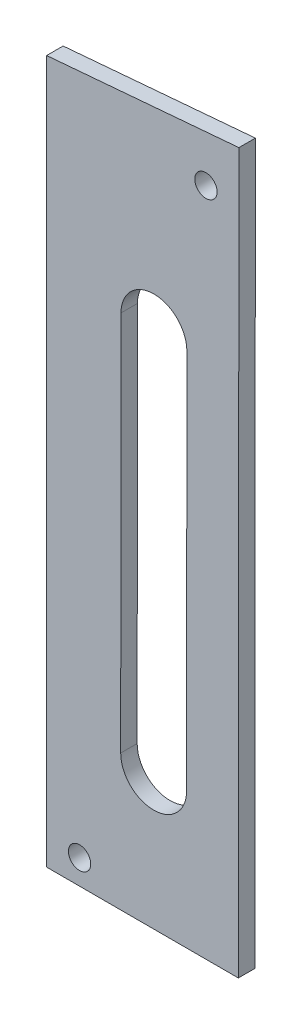
ISO-10303-21;
HEADER;
FILE_DESCRIPTION(('STEP AP214'),'2;1');
FILE_NAME('part.step','',(''),(''),'','','');
FILE_SCHEMA(('AUTOMOTIVE_DESIGN { 1 0 10303 214 1 1 1 1 }'));
ENDSEC;
DATA;
#1=APPLICATION_CONTEXT('core data for automotive mechanical design processes');
#2=APPLICATION_PROTOCOL_DEFINITION('international standard','automotive_design',2000,#1);
#3=PRODUCT_CONTEXT('',#1,'mechanical');
#4=PRODUCT('Part','Part','',(#3));
#5=PRODUCT_RELATED_PRODUCT_CATEGORY('part','',(#4));
#6=PRODUCT_DEFINITION_FORMATION('','',#4);
#7=PRODUCT_DEFINITION_CONTEXT('part definition',#1,'design');
#8=PRODUCT_DEFINITION('design','',#6,#7);
#9=PRODUCT_DEFINITION_SHAPE('','',#8);
#10=(LENGTH_UNIT() NAMED_UNIT(*) SI_UNIT(.MILLI.,.METRE.));
#11=(NAMED_UNIT(*) PLANE_ANGLE_UNIT() SI_UNIT($,.RADIAN.));
#12=(NAMED_UNIT(*) SI_UNIT($,.STERADIAN.) SOLID_ANGLE_UNIT());
#13=UNCERTAINTY_MEASURE_WITH_UNIT(LENGTH_MEASURE(1.E-05),#10,'distance_accuracy_value','');
#14=(GEOMETRIC_REPRESENTATION_CONTEXT(3) GLOBAL_UNCERTAINTY_ASSIGNED_CONTEXT((#13)) GLOBAL_UNIT_ASSIGNED_CONTEXT((#10,
#11,#12)) REPRESENTATION_CONTEXT('',''));
#15=CARTESIAN_POINT('',(0.,0.,0.));
#16=DIRECTION('',(0.,0.,1.));
#17=DIRECTION('',(1.,0.,0.));
#18=AXIS2_PLACEMENT_3D('',#15,#16,#17);
#19=CARTESIAN_POINT('',(0.,0.,3.175));
#20=DIRECTION('',(0.,0.,-1.));
#21=DIRECTION('',(-1.,0.,0.));
#22=AXIS2_PLACEMENT_3D('',#19,#20,#21);
#23=PLANE('',#22);
#24=CARTESIAN_POINT('',(859.905952239611,6619.18728784692,3.175));
#25=DIRECTION('',(0.,0.,1.));
#26=DIRECTION('',(1.,0.,0.));
#27=AXIS2_PLACEMENT_3D('',#24,#25,#26);
#28=CIRCLE('',#27,2.15264999999998);
#29=CARTESIAN_POINT('',(862.058602239611,6619.18728784692,3.175));
#30=VERTEX_POINT('',#29);
#31=EDGE_CURVE('E229',#30,#30,#28,.T.);
#32=ORIENTED_EDGE('',*,*,#31,.F.);
#33=EDGE_LOOP('',(#32));
#34=FACE_BOUND('',#33,.T.);
#35=CARTESIAN_POINT('',(835.549261489273,6494.79713763315,3.175));
#36=DIRECTION('',(0.,0.,1.));
#37=DIRECTION('',(1.,0.,0.));
#38=AXIS2_PLACEMENT_3D('',#35,#36,#37);
#39=CIRCLE('',#38,2.15264999999998);
#40=CARTESIAN_POINT('',(837.701911489273,6494.79713763315,3.175));
#41=VERTEX_POINT('',#40);
#42=EDGE_CURVE('E231',#41,#41,#39,.T.);
#43=ORIENTED_EDGE('',*,*,#42,.F.);
#44=EDGE_LOOP('',(#43));
#45=FACE_BOUND('',#44,.T.);
#46=DIRECTION('',(0.000771841579948994,0.999999702130243,0.));
#47=VECTOR('',#46,1.);
#48=CARTESIAN_POINT('',(866.263292558574,6628.69497115099,3.175));
#49=LINE('',#48,#47);
#50=CARTESIAN_POINT('',(866.1562504809,6490.01101246076,3.175));
#51=VERTEX_POINT('',#50);
#52=CARTESIAN_POINT('',(866.263292558574,6628.69497115099,3.175));
#53=VERTEX_POINT('',#52);
#54=EDGE_CURVE('E135',#51,#53,#49,.T.);
#55=ORIENTED_EDGE('',*,*,#54,.T.);
#56=DIRECTION('',(-0.996390512773561,-0.0848878439756821,0.));
#57=VECTOR('',#56,1.);
#58=CARTESIAN_POINT('',(829.199261489273,6625.53728784692,3.175));
#59=LINE('',#58,#57);
#60=CARTESIAN_POINT('',(829.199261489273,6625.53728784692,3.175));
#61=VERTEX_POINT('',#60);
#62=EDGE_CURVE('E138',#53,#61,#59,.T.);
#63=ORIENTED_EDGE('',*,*,#62,.T.);
#64=DIRECTION('',(0.,-1.,0.));
#65=VECTOR('',#64,1.);
#66=CARTESIAN_POINT('',(829.199261489273,6490.03953741003,3.175));
#67=LINE('',#66,#65);
#68=CARTESIAN_POINT('',(829.199261489273,6490.03953741003,3.175));
#69=VERTEX_POINT('',#68);
#70=EDGE_CURVE('E141',#61,#69,#67,.T.);
#71=ORIENTED_EDGE('',*,*,#70,.T.);
#72=DIRECTION('',(0.999999702130243,-0.000771841579949462,0.));
#73=VECTOR('',#72,1.);
#74=CARTESIAN_POINT('',(866.1562504809,6490.01101246076,3.175));
#75=LINE('',#74,#73);
#76=EDGE_CURVE('E143',#69,#51,#75,.T.);
#77=ORIENTED_EDGE('',*,*,#76,.T.);
#78=EDGE_LOOP('',(#55,#63,#71,#77));
#79=FACE_BOUND('',#78,.T.);
#80=CARTESIAN_POINT('',(849.883207999537,6589.72360237298,3.175));
#81=DIRECTION('',(0.,0.,1.));
#82=DIRECTION('',(1.,0.,0.));
#83=AXIS2_PLACEMENT_3D('',#80,#81,#82);
#84=CIRCLE('',#83,6.35000000000005);
#85=CARTESIAN_POINT('',(856.233206108064,6589.71870117895,3.175));
#86=VERTEX_POINT('',#85);
#87=CARTESIAN_POINT('',(843.53320989101,6589.72850356701,3.175));
#88=VERTEX_POINT('',#87);
#89=EDGE_CURVE('E97',#86,#88,#84,.T.);
#90=ORIENTED_EDGE('',*,*,#89,.F.);
#91=DIRECTION('',(0.000771841579834854,0.999999702130243,0.));
#92=VECTOR('',#91,1.);
#93=CARTESIAN_POINT('',(856.233206108064,6589.71870117895,3.175));
#94=LINE('',#93,#92);
#95=CARTESIAN_POINT('',(856.176475751946,6516.21872307238,3.175));
#96=VERTEX_POINT('',#95);
#97=EDGE_CURVE('E119',#96,#86,#94,.T.);
#98=ORIENTED_EDGE('',*,*,#97,.F.);
#99=CARTESIAN_POINT('',(849.826477643419,6516.22362426641,3.175));
#100=DIRECTION('',(0.,0.,1.));
#101=DIRECTION('',(1.,0.,0.));
#102=AXIS2_PLACEMENT_3D('',#99,#100,#101);
#103=CIRCLE('',#102,6.35000000000005);
#104=CARTESIAN_POINT('',(843.476479534892,6516.22852546044,3.175));
#105=VERTEX_POINT('',#104);
#106=EDGE_CURVE('E117',#105,#96,#103,.T.);
#107=ORIENTED_EDGE('',*,*,#106,.F.);
#108=DIRECTION('',(-0.000771841579834854,-0.999999702130243,0.));
#109=VECTOR('',#108,1.);
#110=CARTESIAN_POINT('',(843.53320989101,6589.72850356701,3.175));
#111=LINE('',#110,#109);
#112=EDGE_CURVE('E105',#88,#105,#111,.T.);
#113=ORIENTED_EDGE('',*,*,#112,.F.);
#114=EDGE_LOOP('',(#90,#98,#107,#113));
#115=FACE_BOUND('',#114,.T.);
#116=ADVANCED_FACE('F32',(#34,#45,#79,#115),#23,.F.);
#117=CARTESIAN_POINT('',(0.,0.,0.));
#118=DIRECTION('',(0.,0.,-1.));
#119=DIRECTION('',(-1.,0.,0.));
#120=AXIS2_PLACEMENT_3D('',#117,#118,#119);
#121=PLANE('',#120);
#122=CARTESIAN_POINT('',(859.905952239611,6619.18728784692,0.));
#123=DIRECTION('',(0.,0.,1.));
#124=DIRECTION('',(1.,0.,0.));
#125=AXIS2_PLACEMENT_3D('',#122,#123,#124);
#126=CIRCLE('',#125,2.15264999999998);
#127=CARTESIAN_POINT('',(862.058602239611,6619.18728784692,0.));
#128=VERTEX_POINT('',#127);
#129=EDGE_CURVE('E227',#128,#128,#126,.T.);
#130=ORIENTED_EDGE('',*,*,#129,.T.);
#131=EDGE_LOOP('',(#130));
#132=FACE_BOUND('',#131,.T.);
#133=CARTESIAN_POINT('',(835.549261489273,6494.79713763315,0.));
#134=DIRECTION('',(0.,0.,1.));
#135=DIRECTION('',(1.,0.,0.));
#136=AXIS2_PLACEMENT_3D('',#133,#134,#135);
#137=CIRCLE('',#136,2.15264999999998);
#138=CARTESIAN_POINT('',(837.701911489273,6494.79713763315,0.));
#139=VERTEX_POINT('',#138);
#140=EDGE_CURVE('E125',#139,#139,#137,.T.);
#141=ORIENTED_EDGE('',*,*,#140,.T.);
#142=EDGE_LOOP('',(#141));
#143=FACE_BOUND('',#142,.T.);
#144=DIRECTION('',(0.000771841579948994,0.999999702130243,0.));
#145=VECTOR('',#144,1.);
#146=CARTESIAN_POINT('',(866.263292558574,6628.69497115099,0.));
#147=LINE('',#146,#145);
#148=CARTESIAN_POINT('',(866.1562504809,6490.01101246076,0.));
#149=VERTEX_POINT('',#148);
#150=CARTESIAN_POINT('',(866.263292558574,6628.69497115099,0.));
#151=VERTEX_POINT('',#150);
#152=EDGE_CURVE('E113',#149,#151,#147,.T.);
#153=ORIENTED_EDGE('',*,*,#152,.F.);
#154=DIRECTION('',(0.999999702130243,-0.000771841579949462,0.));
#155=VECTOR('',#154,1.);
#156=CARTESIAN_POINT('',(866.1562504809,6490.01101246076,0.));
#157=LINE('',#156,#155);
#158=CARTESIAN_POINT('',(829.199261489273,6490.03953741003,0.));
#159=VERTEX_POINT('',#158);
#160=EDGE_CURVE('E139',#159,#149,#157,.T.);
#161=ORIENTED_EDGE('',*,*,#160,.F.);
#162=DIRECTION('',(0.,-1.,0.));
#163=VECTOR('',#162,1.);
#164=CARTESIAN_POINT('',(829.199261489273,6490.03953741003,0.));
#165=LINE('',#164,#163);
#166=CARTESIAN_POINT('',(829.199261489273,6625.53728784692,0.));
#167=VERTEX_POINT('',#166);
#168=EDGE_CURVE('E150',#167,#159,#165,.T.);
#169=ORIENTED_EDGE('',*,*,#168,.F.);
#170=DIRECTION('',(-0.996390512773561,-0.0848878439756821,0.));
#171=VECTOR('',#170,1.);
#172=CARTESIAN_POINT('',(829.199261489273,6625.53728784692,0.));
#173=LINE('',#172,#171);
#174=EDGE_CURVE('E148',#151,#167,#173,.T.);
#175=ORIENTED_EDGE('',*,*,#174,.F.);
#176=EDGE_LOOP('',(#153,#161,#169,#175));
#177=FACE_BOUND('',#176,.T.);
#178=DIRECTION('',(0.000771841579834854,0.999999702130243,0.));
#179=VECTOR('',#178,1.);
#180=CARTESIAN_POINT('',(856.233206108064,6589.71870117895,0.));
#181=LINE('',#180,#179);
#182=CARTESIAN_POINT('',(856.176475751946,6516.21872307238,0.));
#183=VERTEX_POINT('',#182);
#184=CARTESIAN_POINT('',(856.233206108064,6589.71870117895,0.));
#185=VERTEX_POINT('',#184);
#186=EDGE_CURVE('E106',#183,#185,#181,.T.);
#187=ORIENTED_EDGE('',*,*,#186,.T.);
#188=CARTESIAN_POINT('',(849.883207999537,6589.72360237298,0.));
#189=DIRECTION('',(0.,0.,1.));
#190=DIRECTION('',(1.,0.,0.));
#191=AXIS2_PLACEMENT_3D('',#188,#189,#190);
#192=CIRCLE('',#191,6.35000000000005);
#193=CARTESIAN_POINT('',(843.53320989101,6589.72850356701,0.));
#194=VERTEX_POINT('',#193);
#195=EDGE_CURVE('E55',#185,#194,#192,.T.);
#196=ORIENTED_EDGE('',*,*,#195,.T.);
#197=DIRECTION('',(-0.000771841579834854,-0.999999702130243,0.));
#198=VECTOR('',#197,1.);
#199=CARTESIAN_POINT('',(843.53320989101,6589.72850356701,0.));
#200=LINE('',#199,#198);
#201=CARTESIAN_POINT('',(843.476479534892,6516.22852546044,0.));
#202=VERTEX_POINT('',#201);
#203=EDGE_CURVE('E112',#194,#202,#200,.T.);
#204=ORIENTED_EDGE('',*,*,#203,.T.);
#205=CARTESIAN_POINT('',(849.826477643419,6516.22362426641,0.));
#206=DIRECTION('',(0.,0.,1.));
#207=DIRECTION('',(1.,0.,0.));
#208=AXIS2_PLACEMENT_3D('',#205,#206,#207);
#209=CIRCLE('',#208,6.35000000000005);
#210=EDGE_CURVE('E127',#202,#183,#209,.T.);
#211=ORIENTED_EDGE('',*,*,#210,.T.);
#212=EDGE_LOOP('',(#187,#196,#204,#211));
#213=FACE_BOUND('',#212,.T.);
#214=ADVANCED_FACE('F168',(#132,#143,#177,#213),#121,.T.);
#215=CARTESIAN_POINT('',(866.263292558574,6628.69497115099,3.175));
#216=DIRECTION('',(-0.999999702130243,0.000771841579948994,0.));
#217=DIRECTION('',(-0.000771841579948994,-0.999999702130243,0.));
#218=AXIS2_PLACEMENT_3D('',#215,#216,#217);
#219=PLANE('',#218);
#220=ORIENTED_EDGE('',*,*,#152,.T.);
#221=DIRECTION('',(0.,0.,-1.));
#222=VECTOR('',#221,1.);
#223=CARTESIAN_POINT('',(866.263292558574,6628.69497115099,3.175));
#224=LINE('',#223,#222);
#225=EDGE_CURVE('E11',#53,#151,#224,.T.);
#226=ORIENTED_EDGE('',*,*,#225,.F.);
#227=ORIENTED_EDGE('',*,*,#54,.F.);
#228=DIRECTION('',(0.,0.,-1.));
#229=VECTOR('',#228,1.);
#230=CARTESIAN_POINT('',(866.1562504809,6490.01101246076,3.175));
#231=LINE('',#230,#229);
#232=EDGE_CURVE('E145',#51,#149,#231,.T.);
#233=ORIENTED_EDGE('',*,*,#232,.T.);
#234=EDGE_LOOP('',(#220,#226,#227,#233));
#235=FACE_BOUND('',#234,.T.);
#236=ADVANCED_FACE('F34',(#235),#219,.F.);
#237=CARTESIAN_POINT('',(829.199261489273,6625.53728784692,3.175));
#238=DIRECTION('',(0.0848878439756822,-0.996390512773561,0.));
#239=DIRECTION('',(0.996390512773561,0.0848878439756822,0.));
#240=AXIS2_PLACEMENT_3D('',#237,#238,#239);
#241=PLANE('',#240);
#242=ORIENTED_EDGE('',*,*,#174,.T.);
#243=DIRECTION('',(0.,0.,-1.));
#244=VECTOR('',#243,1.);
#245=CARTESIAN_POINT('',(829.199261489273,6625.53728784692,3.175));
#246=LINE('',#245,#244);
#247=EDGE_CURVE('E40',#61,#167,#246,.T.);
#248=ORIENTED_EDGE('',*,*,#247,.F.);
#249=ORIENTED_EDGE('',*,*,#62,.F.);
#250=ORIENTED_EDGE('',*,*,#225,.T.);
#251=EDGE_LOOP('',(#242,#248,#249,#250));
#252=FACE_BOUND('',#251,.T.);
#253=ADVANCED_FACE('F178',(#252),#241,.F.);
#254=CARTESIAN_POINT('',(829.199261489273,6490.03953741003,3.175));
#255=DIRECTION('',(1.,0.,0.));
#256=DIRECTION('',(0.,0.,-1.));
#257=AXIS2_PLACEMENT_3D('',#254,#255,#256);
#258=PLANE('',#257);
#259=ORIENTED_EDGE('',*,*,#168,.T.);
#260=DIRECTION('',(0.,0.,-1.));
#261=VECTOR('',#260,1.);
#262=CARTESIAN_POINT('',(829.199261489273,6490.03953741003,3.175));
#263=LINE('',#262,#261);
#264=EDGE_CURVE('E155',#69,#159,#263,.T.);
#265=ORIENTED_EDGE('',*,*,#264,.F.);
#266=ORIENTED_EDGE('',*,*,#70,.F.);
#267=ORIENTED_EDGE('',*,*,#247,.T.);
#268=EDGE_LOOP('',(#259,#265,#266,#267));
#269=FACE_BOUND('',#268,.T.);
#270=ADVANCED_FACE('F162',(#269),#258,.F.);
#271=CARTESIAN_POINT('',(866.1562504809,6490.01101246076,3.175));
#272=DIRECTION('',(0.000771841579949462,0.999999702130243,0.));
#273=DIRECTION('',(-0.999999702130243,0.000771841579949462,0.));
#274=AXIS2_PLACEMENT_3D('',#271,#272,#273);
#275=PLANE('',#274);
#276=ORIENTED_EDGE('',*,*,#160,.T.);
#277=ORIENTED_EDGE('',*,*,#232,.F.);
#278=ORIENTED_EDGE('',*,*,#76,.F.);
#279=ORIENTED_EDGE('',*,*,#264,.T.);
#280=EDGE_LOOP('',(#276,#277,#278,#279));
#281=FACE_BOUND('',#280,.T.);
#282=ADVANCED_FACE('F172',(#281),#275,.F.);
#283=CARTESIAN_POINT('',(849.883207999537,6589.72360237298,3.175));
#284=DIRECTION('',(0.,0.,-1.));
#285=DIRECTION('',(-1.,0.,0.));
#286=AXIS2_PLACEMENT_3D('',#283,#284,#285);
#287=CYLINDRICAL_SURFACE('',#286,6.35000000000005);
#288=ORIENTED_EDGE('',*,*,#195,.F.);
#289=DIRECTION('',(0.,0.,-1.));
#290=VECTOR('',#289,1.);
#291=CARTESIAN_POINT('',(856.233206108064,6589.71870117895,3.175));
#292=LINE('',#291,#290);
#293=EDGE_CURVE('E101',#86,#185,#292,.T.);
#294=ORIENTED_EDGE('',*,*,#293,.F.);
#295=ORIENTED_EDGE('',*,*,#89,.T.);
#296=DIRECTION('',(0.,0.,-1.));
#297=VECTOR('',#296,1.);
#298=CARTESIAN_POINT('',(843.53320989101,6589.72850356701,3.175));
#299=LINE('',#298,#297);
#300=EDGE_CURVE('E100',#88,#194,#299,.T.);
#301=ORIENTED_EDGE('',*,*,#300,.T.);
#302=EDGE_LOOP('',(#288,#294,#295,#301));
#303=FACE_BOUND('',#302,.T.);
#304=ADVANCED_FACE('F99',(#303),#287,.F.);
#305=CARTESIAN_POINT('',(843.53320989101,6589.72850356701,3.175));
#306=DIRECTION('',(0.999999702130243,-0.000771841579834854,0.));
#307=DIRECTION('',(0.000771841579834854,0.999999702130244,0.));
#308=AXIS2_PLACEMENT_3D('',#305,#306,#307);
#309=PLANE('',#308);
#310=ORIENTED_EDGE('',*,*,#203,.F.);
#311=ORIENTED_EDGE('',*,*,#300,.F.);
#312=ORIENTED_EDGE('',*,*,#112,.T.);
#313=DIRECTION('',(0.,0.,-1.));
#314=VECTOR('',#313,1.);
#315=CARTESIAN_POINT('',(843.476479534892,6516.22852546044,3.175));
#316=LINE('',#315,#314);
#317=EDGE_CURVE('E114',#105,#202,#316,.T.);
#318=ORIENTED_EDGE('',*,*,#317,.T.);
#319=EDGE_LOOP('',(#310,#311,#312,#318));
#320=FACE_BOUND('',#319,.T.);
#321=ADVANCED_FACE('F109',(#320),#309,.T.);
#322=CARTESIAN_POINT('',(849.826477643419,6516.22362426641,3.175));
#323=DIRECTION('',(0.,0.,-1.));
#324=DIRECTION('',(-1.,0.,0.));
#325=AXIS2_PLACEMENT_3D('',#322,#323,#324);
#326=CYLINDRICAL_SURFACE('',#325,6.35000000000005);
#327=ORIENTED_EDGE('',*,*,#210,.F.);
#328=ORIENTED_EDGE('',*,*,#317,.F.);
#329=ORIENTED_EDGE('',*,*,#106,.T.);
#330=DIRECTION('',(0.,0.,-1.));
#331=VECTOR('',#330,1.);
#332=CARTESIAN_POINT('',(856.176475751946,6516.21872307238,3.175));
#333=LINE('',#332,#331);
#334=EDGE_CURVE('E47',#96,#183,#333,.T.);
#335=ORIENTED_EDGE('',*,*,#334,.T.);
#336=EDGE_LOOP('',(#327,#328,#329,#335));
#337=FACE_BOUND('',#336,.T.);
#338=ADVANCED_FACE('F205',(#337),#326,.F.);
#339=CARTESIAN_POINT('',(856.233206108064,6589.71870117895,3.175));
#340=DIRECTION('',(-0.999999702130243,0.000771841579834854,0.));
#341=DIRECTION('',(-0.000771841579834854,-0.999999702130244,0.));
#342=AXIS2_PLACEMENT_3D('',#339,#340,#341);
#343=PLANE('',#342);
#344=ORIENTED_EDGE('',*,*,#186,.F.);
#345=ORIENTED_EDGE('',*,*,#334,.F.);
#346=ORIENTED_EDGE('',*,*,#97,.T.);
#347=ORIENTED_EDGE('',*,*,#293,.T.);
#348=EDGE_LOOP('',(#344,#345,#346,#347));
#349=FACE_BOUND('',#348,.T.);
#350=ADVANCED_FACE('F209',(#349),#343,.T.);
#351=CARTESIAN_POINT('',(835.549261489273,6494.79713763315,3.175));
#352=DIRECTION('',(0.,0.,1.));
#353=DIRECTION('',(1.,0.,0.));
#354=AXIS2_PLACEMENT_3D('',#351,#352,#353);
#355=CYLINDRICAL_SURFACE('',#354,2.15264999999998);
#356=ORIENTED_EDGE('',*,*,#140,.F.);
#357=EDGE_LOOP('',(#356));
#358=FACE_BOUND('',#357,.T.);
#359=ORIENTED_EDGE('',*,*,#42,.T.);
#360=EDGE_LOOP('',(#359));
#361=FACE_BOUND('',#360,.T.);
#362=ADVANCED_FACE('F215',(#358,#361),#355,.F.);
#363=CARTESIAN_POINT('',(859.905952239611,6619.18728784692,3.175));
#364=DIRECTION('',(0.,0.,1.));
#365=DIRECTION('',(1.,0.,0.));
#366=AXIS2_PLACEMENT_3D('',#363,#364,#365);
#367=CYLINDRICAL_SURFACE('',#366,2.15264999999998);
#368=ORIENTED_EDGE('',*,*,#129,.F.);
#369=EDGE_LOOP('',(#368));
#370=FACE_BOUND('',#369,.T.);
#371=ORIENTED_EDGE('',*,*,#31,.T.);
#372=EDGE_LOOP('',(#371));
#373=FACE_BOUND('',#372,.T.);
#374=ADVANCED_FACE('F218',(#370,#373),#367,.F.);
#375=CLOSED_SHELL('',(#116,#214,#236,#253,#270,#282,#304,#321,#338,#350,#362,#374));
#376=MANIFOLD_SOLID_BREP('B2',#375);
#377=ADVANCED_BREP_SHAPE_REPRESENTATION('',(#18,#376),#14);
#378=SHAPE_DEFINITION_REPRESENTATION(#9,#377);
ENDSEC;
END-ISO-10303-21;
